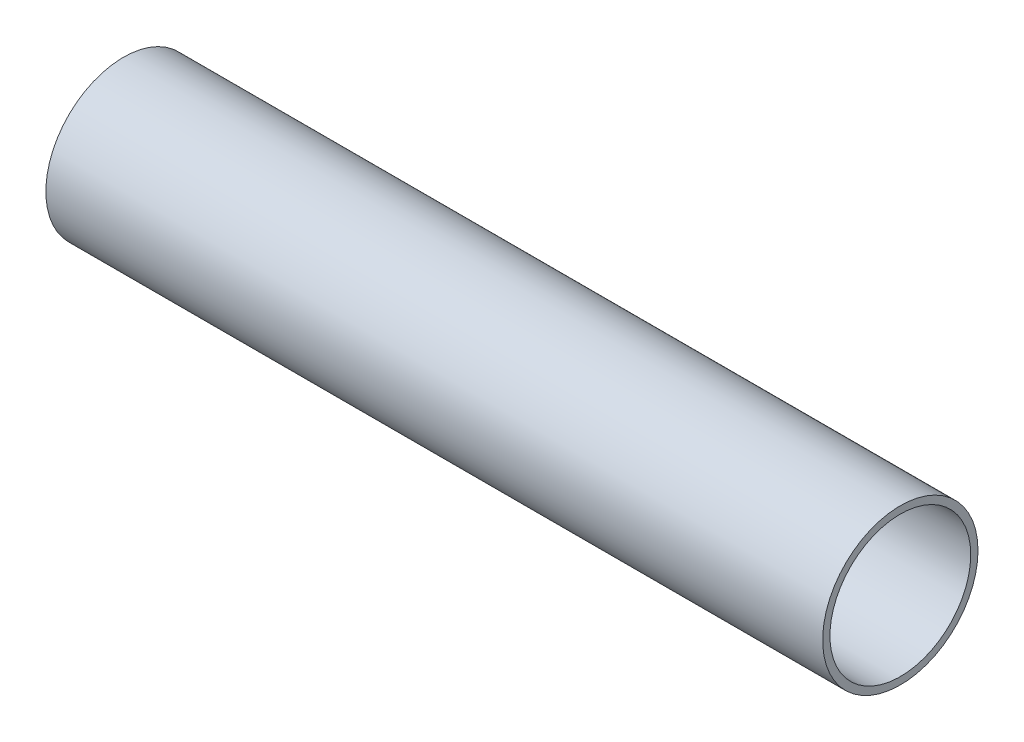
ISO-10303-21;
HEADER;
FILE_DESCRIPTION(('STEP AP214'),'2;1');
FILE_NAME('part.step','',(''),(''),'','','');
FILE_SCHEMA(('AUTOMOTIVE_DESIGN { 1 0 10303 214 1 1 1 1 }'));
ENDSEC;
DATA;
#1=APPLICATION_CONTEXT('core data for automotive mechanical design processes');
#2=APPLICATION_PROTOCOL_DEFINITION('international standard','automotive_design',2000,#1);
#3=PRODUCT_CONTEXT('',#1,'mechanical');
#4=PRODUCT('Part','Part','',(#3));
#5=PRODUCT_RELATED_PRODUCT_CATEGORY('part','',(#4));
#6=PRODUCT_DEFINITION_FORMATION('','',#4);
#7=PRODUCT_DEFINITION_CONTEXT('part definition',#1,'design');
#8=PRODUCT_DEFINITION('design','',#6,#7);
#9=PRODUCT_DEFINITION_SHAPE('','',#8);
#10=(LENGTH_UNIT() NAMED_UNIT(*) SI_UNIT(.MILLI.,.METRE.));
#11=(NAMED_UNIT(*) PLANE_ANGLE_UNIT() SI_UNIT($,.RADIAN.));
#12=(NAMED_UNIT(*) SI_UNIT($,.STERADIAN.) SOLID_ANGLE_UNIT());
#13=UNCERTAINTY_MEASURE_WITH_UNIT(LENGTH_MEASURE(1.E-05),#10,'distance_accuracy_value','');
#14=(GEOMETRIC_REPRESENTATION_CONTEXT(3) GLOBAL_UNCERTAINTY_ASSIGNED_CONTEXT((#13)) GLOBAL_UNIT_ASSIGNED_CONTEXT((#10,
#11,#12)) REPRESENTATION_CONTEXT('',''));
#15=CARTESIAN_POINT('',(0.,0.,0.));
#16=DIRECTION('',(0.,0.,1.));
#17=DIRECTION('',(1.,0.,0.));
#18=AXIS2_PLACEMENT_3D('',#15,#16,#17);
#19=CARTESIAN_POINT('',(0.,0.,0.));
#20=DIRECTION('',(1.,0.,0.));
#21=DIRECTION('',(0.,0.,-1.));
#22=AXIS2_PLACEMENT_3D('',#19,#20,#21);
#23=CYLINDRICAL_SURFACE('',#22,8.);
#24=CARTESIAN_POINT('',(0.,0.,0.));
#25=DIRECTION('',(1.,0.,0.));
#26=DIRECTION('',(0.,0.,-1.));
#27=AXIS2_PLACEMENT_3D('',#24,#25,#26);
#28=CIRCLE('',#27,8.);
#29=CARTESIAN_POINT('',(0.,0.,-8.));
#30=VERTEX_POINT('',#29);
#31=EDGE_CURVE('E10',#30,#30,#28,.T.);
#32=ORIENTED_EDGE('',*,*,#31,.T.);
#33=EDGE_LOOP('',(#32));
#34=FACE_BOUND('',#33,.T.);
#35=CARTESIAN_POINT('',(80.,0.,0.));
#36=DIRECTION('',(1.,0.,0.));
#37=DIRECTION('',(0.,0.,-1.));
#38=AXIS2_PLACEMENT_3D('',#35,#36,#37);
#39=CIRCLE('',#38,8.);
#40=CARTESIAN_POINT('',(80.,0.,-8.));
#41=VERTEX_POINT('',#40);
#42=EDGE_CURVE('E45',#41,#41,#39,.T.);
#43=ORIENTED_EDGE('',*,*,#42,.F.);
#44=EDGE_LOOP('',(#43));
#45=FACE_BOUND('',#44,.T.);
#46=ADVANCED_FACE('F31',(#34,#45),#23,.T.);
#47=CARTESIAN_POINT('',(0.,8.,0.));
#48=DIRECTION('',(-1.,0.,0.));
#49=DIRECTION('',(0.,0.,1.));
#50=AXIS2_PLACEMENT_3D('',#47,#48,#49);
#51=PLANE('',#50);
#52=CARTESIAN_POINT('',(0.,0.,0.));
#53=DIRECTION('',(1.,0.,0.));
#54=DIRECTION('',(0.,0.,-1.));
#55=AXIS2_PLACEMENT_3D('',#52,#53,#54);
#56=CIRCLE('',#55,7.25);
#57=CARTESIAN_POINT('',(0.,0.,-7.25));
#58=VERTEX_POINT('',#57);
#59=EDGE_CURVE('E37',#58,#58,#56,.T.);
#60=ORIENTED_EDGE('',*,*,#59,.T.);
#61=EDGE_LOOP('',(#60));
#62=FACE_BOUND('',#61,.T.);
#63=ORIENTED_EDGE('',*,*,#31,.F.);
#64=EDGE_LOOP('',(#63));
#65=FACE_BOUND('',#64,.T.);
#66=ADVANCED_FACE('F55',(#62,#65),#51,.T.);
#67=CARTESIAN_POINT('',(0.,0.,0.));
#68=DIRECTION('',(1.,0.,0.));
#69=DIRECTION('',(0.,0.,-1.));
#70=AXIS2_PLACEMENT_3D('',#67,#68,#69);
#71=CYLINDRICAL_SURFACE('',#70,7.25);
#72=CARTESIAN_POINT('',(80.,0.,0.));
#73=DIRECTION('',(1.,0.,0.));
#74=DIRECTION('',(0.,0.,-1.));
#75=AXIS2_PLACEMENT_3D('',#72,#73,#74);
#76=CIRCLE('',#75,7.25);
#77=CARTESIAN_POINT('',(80.,0.,-7.25));
#78=VERTEX_POINT('',#77);
#79=EDGE_CURVE('E41',#78,#78,#76,.T.);
#80=ORIENTED_EDGE('',*,*,#79,.T.);
#81=EDGE_LOOP('',(#80));
#82=FACE_BOUND('',#81,.T.);
#83=ORIENTED_EDGE('',*,*,#59,.F.);
#84=EDGE_LOOP('',(#83));
#85=FACE_BOUND('',#84,.T.);
#86=ADVANCED_FACE('F59',(#82,#85),#71,.F.);
#87=CARTESIAN_POINT('',(80.,7.25,0.));
#88=DIRECTION('',(1.,0.,0.));
#89=DIRECTION('',(0.,0.,-1.));
#90=AXIS2_PLACEMENT_3D('',#87,#88,#89);
#91=PLANE('',#90);
#92=ORIENTED_EDGE('',*,*,#42,.T.);
#93=EDGE_LOOP('',(#92));
#94=FACE_BOUND('',#93,.T.);
#95=ORIENTED_EDGE('',*,*,#79,.F.);
#96=EDGE_LOOP('',(#95));
#97=FACE_BOUND('',#96,.T.);
#98=ADVANCED_FACE('F51',(#94,#97),#91,.T.);
#99=CLOSED_SHELL('',(#46,#66,#86,#98));
#100=MANIFOLD_SOLID_BREP('B2',#99);
#101=ADVANCED_BREP_SHAPE_REPRESENTATION('',(#18,#100),#14);
#102=SHAPE_DEFINITION_REPRESENTATION(#9,#101);
ENDSEC;
END-ISO-10303-21;
